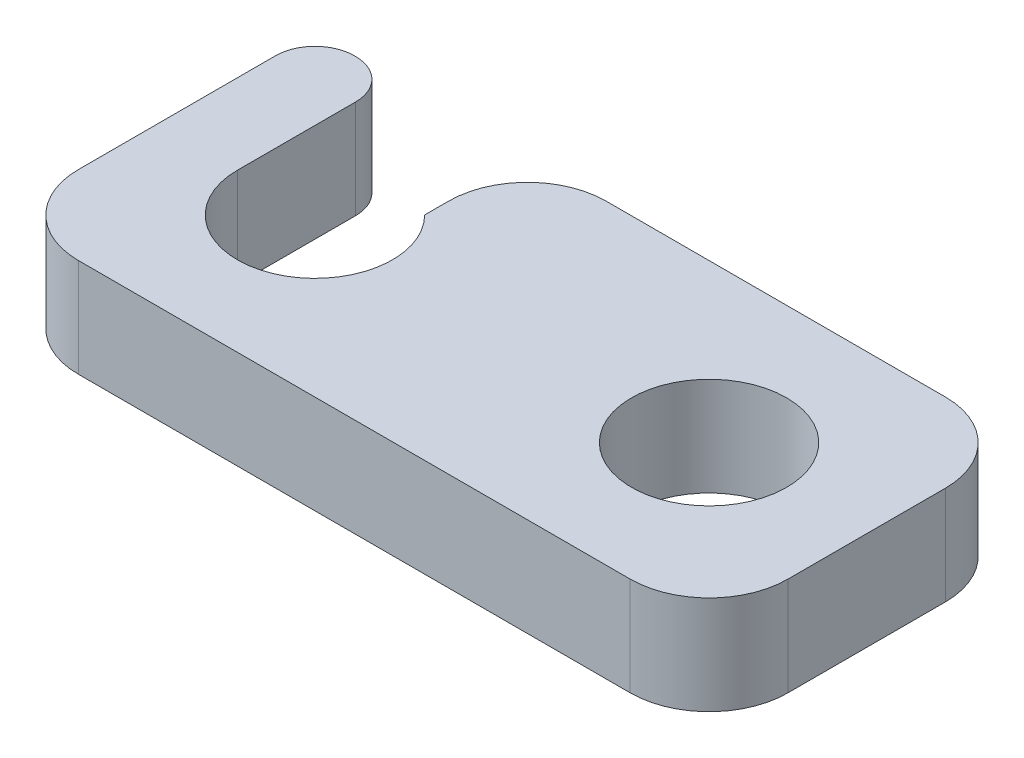
ISO-10303-21;
HEADER;
FILE_DESCRIPTION(('STEP AP214'),'2;1');
FILE_NAME('part.step','',(''),(''),'','','');
FILE_SCHEMA(('AUTOMOTIVE_DESIGN { 1 0 10303 214 1 1 1 1 }'));
ENDSEC;
DATA;
#1=APPLICATION_CONTEXT('core data for automotive mechanical design processes');
#2=APPLICATION_PROTOCOL_DEFINITION('international standard','automotive_design',2000,#1);
#3=PRODUCT_CONTEXT('',#1,'mechanical');
#4=PRODUCT('Part','Part','',(#3));
#5=PRODUCT_RELATED_PRODUCT_CATEGORY('part','',(#4));
#6=PRODUCT_DEFINITION_FORMATION('','',#4);
#7=PRODUCT_DEFINITION_CONTEXT('part definition',#1,'design');
#8=PRODUCT_DEFINITION('design','',#6,#7);
#9=PRODUCT_DEFINITION_SHAPE('','',#8);
#10=(LENGTH_UNIT() NAMED_UNIT(*) SI_UNIT(.MILLI.,.METRE.));
#11=(NAMED_UNIT(*) PLANE_ANGLE_UNIT() SI_UNIT($,.RADIAN.));
#12=(NAMED_UNIT(*) SI_UNIT($,.STERADIAN.) SOLID_ANGLE_UNIT());
#13=UNCERTAINTY_MEASURE_WITH_UNIT(LENGTH_MEASURE(1.E-05),#10,'distance_accuracy_value','');
#14=(GEOMETRIC_REPRESENTATION_CONTEXT(3) GLOBAL_UNCERTAINTY_ASSIGNED_CONTEXT((#13)) GLOBAL_UNIT_ASSIGNED_CONTEXT((#10,
#11,#12)) REPRESENTATION_CONTEXT('',''));
#15=CARTESIAN_POINT('',(0.,0.,0.));
#16=DIRECTION('',(0.,0.,1.));
#17=DIRECTION('',(1.,0.,0.));
#18=AXIS2_PLACEMENT_3D('',#15,#16,#17);
#19=CARTESIAN_POINT('',(-11.43,3.175,-5.08));
#20=DIRECTION('',(0.,0.,1.));
#21=DIRECTION('',(1.,0.,0.));
#22=AXIS2_PLACEMENT_3D('',#19,#20,#21);
#23=PLANE('',#22);
#24=DIRECTION('',(-1.,0.,0.));
#25=VECTOR('',#24,1.);
#26=CARTESIAN_POINT('',(-11.43,0.,-5.08));
#27=LINE('',#26,#25);
#28=CARTESIAN_POINT('',(-10.12,0.,-5.08));
#29=VERTEX_POINT('',#28);
#30=CARTESIAN_POINT('',(-10.16,0.,-5.08));
#31=VERTEX_POINT('',#30);
#32=EDGE_CURVE('E173',#29,#31,#27,.T.);
#33=ORIENTED_EDGE('',*,*,#32,.T.);
#34=DIRECTION('',(0.,-1.,0.));
#35=VECTOR('',#34,1.);
#36=CARTESIAN_POINT('',(-10.16,3.175,-5.08));
#37=LINE('',#36,#35);
#38=CARTESIAN_POINT('',(-10.16,3.175,-5.08));
#39=VERTEX_POINT('',#38);
#40=EDGE_CURVE('E61',#31,#39,#37,.F.);
#41=ORIENTED_EDGE('',*,*,#40,.T.);
#42=DIRECTION('',(-1.,0.,0.));
#43=VECTOR('',#42,1.);
#44=CARTESIAN_POINT('',(-11.43,3.175,-5.08));
#45=LINE('',#44,#43);
#46=CARTESIAN_POINT('',(-10.12,3.175,-5.08));
#47=VERTEX_POINT('',#46);
#48=EDGE_CURVE('E186',#47,#39,#45,.T.);
#49=ORIENTED_EDGE('',*,*,#48,.F.);
#50=DIRECTION('',(0.,1.,0.));
#51=VECTOR('',#50,1.);
#52=CARTESIAN_POINT('',(-10.12,3.175,-5.08));
#53=LINE('',#52,#51);
#54=EDGE_CURVE('E247',#47,#29,#53,.F.);
#55=ORIENTED_EDGE('',*,*,#54,.T.);
#56=EDGE_LOOP('',(#33,#41,#49,#55));
#57=FACE_BOUND('',#56,.T.);
#58=ADVANCED_FACE('F39',(#57),#23,.F.);
#59=CARTESIAN_POINT('',(-6.35,0.,0.));
#60=DIRECTION('',(0.,1.,0.));
#61=DIRECTION('',(0.,0.,1.));
#62=AXIS2_PLACEMENT_3D('',#59,#60,#61);
#63=CYLINDRICAL_SURFACE('',#62,2.5);
#64=DIRECTION('',(0.,1.,0.));
#65=VECTOR('',#64,1.);
#66=CARTESIAN_POINT('',(-8.85,0.,0.));
#67=LINE('',#66,#65);
#68=CARTESIAN_POINT('',(-8.85,0.,0.));
#69=VERTEX_POINT('',#68);
#70=CARTESIAN_POINT('',(-8.85,3.175,0.));
#71=VERTEX_POINT('',#70);
#72=EDGE_CURVE('E158',#69,#71,#67,.T.);
#73=ORIENTED_EDGE('',*,*,#72,.T.);
#74=CARTESIAN_POINT('',(-6.35,3.175,0.));
#75=DIRECTION('',(0.,1.,0.));
#76=DIRECTION('',(0.,0.,1.));
#77=AXIS2_PLACEMENT_3D('',#74,#75,#76);
#78=CIRCLE('',#77,2.5);
#79=CARTESIAN_POINT('',(-4.58454594939093,3.175,-1.77007683313127));
#80=VERTEX_POINT('',#79);
#81=EDGE_CURVE('E170',#71,#80,#78,.T.);
#82=ORIENTED_EDGE('',*,*,#81,.T.);
#83=DIRECTION('',(0.,1.,0.));
#84=VECTOR('',#83,1.);
#85=CARTESIAN_POINT('',(-4.58454594939093,0.,-1.77007683313127));
#86=LINE('',#85,#84);
#87=CARTESIAN_POINT('',(-4.58454594939093,0.,-1.77007683313127));
#88=VERTEX_POINT('',#87);
#89=EDGE_CURVE('E154',#88,#80,#86,.T.);
#90=ORIENTED_EDGE('',*,*,#89,.F.);
#91=CARTESIAN_POINT('',(-6.35,0.,0.));
#92=DIRECTION('',(0.,1.,0.));
#93=DIRECTION('',(0.,0.,1.));
#94=AXIS2_PLACEMENT_3D('',#91,#92,#93);
#95=CIRCLE('',#94,2.5);
#96=EDGE_CURVE('E149',#69,#88,#95,.T.);
#97=ORIENTED_EDGE('',*,*,#96,.F.);
#98=EDGE_LOOP('',(#73,#82,#90,#97));
#99=FACE_BOUND('',#98,.T.);
#100=ADVANCED_FACE('F168',(#99),#63,.F.);
#101=CARTESIAN_POINT('',(11.43,3.175,5.08));
#102=DIRECTION('',(-1.,0.,0.));
#103=DIRECTION('',(0.,0.,1.));
#104=AXIS2_PLACEMENT_3D('',#101,#102,#103);
#105=PLANE('',#104);
#106=DIRECTION('',(0.,0.,-1.));
#107=VECTOR('',#106,1.);
#108=CARTESIAN_POINT('',(11.43,3.175,5.08));
#109=LINE('',#108,#107);
#110=CARTESIAN_POINT('',(11.43,3.175,2.54));
#111=VERTEX_POINT('',#110);
#112=CARTESIAN_POINT('',(11.43,3.175,-2.54));
#113=VERTEX_POINT('',#112);
#114=EDGE_CURVE('E183',#111,#113,#109,.T.);
#115=ORIENTED_EDGE('',*,*,#114,.F.);
#116=DIRECTION('',(0.,-1.,0.));
#117=VECTOR('',#116,1.);
#118=CARTESIAN_POINT('',(11.43,3.175,2.54));
#119=LINE('',#118,#117);
#120=CARTESIAN_POINT('',(11.43,0.,2.54));
#121=VERTEX_POINT('',#120);
#122=EDGE_CURVE('E238',#111,#121,#119,.T.);
#123=ORIENTED_EDGE('',*,*,#122,.T.);
#124=DIRECTION('',(0.,0.,-1.));
#125=VECTOR('',#124,1.);
#126=CARTESIAN_POINT('',(11.43,0.,5.08));
#127=LINE('',#126,#125);
#128=CARTESIAN_POINT('',(11.43,0.,-2.54));
#129=VERTEX_POINT('',#128);
#130=EDGE_CURVE('E169',#121,#129,#127,.T.);
#131=ORIENTED_EDGE('',*,*,#130,.T.);
#132=DIRECTION('',(0.,-1.,0.));
#133=VECTOR('',#132,1.);
#134=CARTESIAN_POINT('',(11.43,3.175,-2.54));
#135=LINE('',#134,#133);
#136=EDGE_CURVE('E236',#129,#113,#135,.F.);
#137=ORIENTED_EDGE('',*,*,#136,.T.);
#138=EDGE_LOOP('',(#115,#123,#131,#137));
#139=FACE_BOUND('',#138,.T.);
#140=ADVANCED_FACE('F286',(#139),#105,.F.);
#141=CARTESIAN_POINT('',(8.89,0.,-5.08));
#142=VERTEX_POINT('',#141);
#143=CARTESIAN_POINT('',(-2.04454594939093,0.,-5.08));
#144=VERTEX_POINT('',#143);
#145=EDGE_CURVE('E197',#142,#144,#27,.T.);
#146=ORIENTED_EDGE('',*,*,#145,.T.);
#147=DIRECTION('',(0.,1.,0.));
#148=VECTOR('',#147,1.);
#149=CARTESIAN_POINT('',(-2.04454594939093,3.175,-5.08));
#150=LINE('',#149,#148);
#151=CARTESIAN_POINT('',(-2.04454594939093,3.175,-5.08));
#152=VERTEX_POINT('',#151);
#153=EDGE_CURVE('E231',#144,#152,#150,.T.);
#154=ORIENTED_EDGE('',*,*,#153,.T.);
#155=CARTESIAN_POINT('',(8.89,3.175,-5.08));
#156=VERTEX_POINT('',#155);
#157=EDGE_CURVE('E188',#156,#152,#45,.T.);
#158=ORIENTED_EDGE('',*,*,#157,.F.);
#159=DIRECTION('',(0.,-1.,0.));
#160=VECTOR('',#159,1.);
#161=CARTESIAN_POINT('',(8.89,3.175,-5.08));
#162=LINE('',#161,#160);
#163=EDGE_CURVE('E228',#156,#142,#162,.T.);
#164=ORIENTED_EDGE('',*,*,#163,.T.);
#165=EDGE_LOOP('',(#146,#154,#158,#164));
#166=FACE_BOUND('',#165,.T.);
#167=ADVANCED_FACE('F276',(#166),#23,.F.);
#168=CARTESIAN_POINT('',(-11.43,3.175,5.08));
#169=DIRECTION('',(1.,0.,0.));
#170=DIRECTION('',(0.,0.,-1.));
#171=AXIS2_PLACEMENT_3D('',#168,#169,#170);
#172=PLANE('',#171);
#173=DIRECTION('',(0.,0.,1.));
#174=VECTOR('',#173,1.);
#175=CARTESIAN_POINT('',(-11.43,3.175,5.08));
#176=LINE('',#175,#174);
#177=CARTESIAN_POINT('',(-11.43,3.175,-3.81));
#178=VERTEX_POINT('',#177);
#179=CARTESIAN_POINT('',(-11.43,3.175,2.54));
#180=VERTEX_POINT('',#179);
#181=EDGE_CURVE('E191',#178,#180,#176,.T.);
#182=ORIENTED_EDGE('',*,*,#181,.F.);
#183=DIRECTION('',(0.,-1.,0.));
#184=VECTOR('',#183,1.);
#185=CARTESIAN_POINT('',(-11.43,3.175,-3.81));
#186=LINE('',#185,#184);
#187=CARTESIAN_POINT('',(-11.43,0.,-3.81));
#188=VERTEX_POINT('',#187);
#189=EDGE_CURVE('E241',#178,#188,#186,.T.);
#190=ORIENTED_EDGE('',*,*,#189,.T.);
#191=DIRECTION('',(0.,0.,1.));
#192=VECTOR('',#191,1.);
#193=CARTESIAN_POINT('',(-11.43,0.,5.08));
#194=LINE('',#193,#192);
#195=CARTESIAN_POINT('',(-11.43,0.,2.54));
#196=VERTEX_POINT('',#195);
#197=EDGE_CURVE('E200',#188,#196,#194,.T.);
#198=ORIENTED_EDGE('',*,*,#197,.T.);
#199=DIRECTION('',(0.,-1.,0.));
#200=VECTOR('',#199,1.);
#201=CARTESIAN_POINT('',(-11.43,3.175,2.54));
#202=LINE('',#201,#200);
#203=EDGE_CURVE('E217',#196,#180,#202,.F.);
#204=ORIENTED_EDGE('',*,*,#203,.T.);
#205=EDGE_LOOP('',(#182,#190,#198,#204));
#206=FACE_BOUND('',#205,.T.);
#207=ADVANCED_FACE('F257',(#206),#172,.F.);
#208=CARTESIAN_POINT('',(-11.43,3.175,5.08));
#209=DIRECTION('',(0.,0.,-1.));
#210=DIRECTION('',(-1.,0.,0.));
#211=AXIS2_PLACEMENT_3D('',#208,#209,#210);
#212=PLANE('',#211);
#213=DIRECTION('',(1.,0.,0.));
#214=VECTOR('',#213,1.);
#215=CARTESIAN_POINT('',(-11.43,3.175,5.08));
#216=LINE('',#215,#214);
#217=CARTESIAN_POINT('',(-8.89,3.175,5.08));
#218=VERTEX_POINT('',#217);
#219=CARTESIAN_POINT('',(8.89,3.175,5.08));
#220=VERTEX_POINT('',#219);
#221=EDGE_CURVE('E193',#218,#220,#216,.T.);
#222=ORIENTED_EDGE('',*,*,#221,.F.);
#223=DIRECTION('',(0.,-1.,0.));
#224=VECTOR('',#223,1.);
#225=CARTESIAN_POINT('',(-8.89,3.175,5.08));
#226=LINE('',#225,#224);
#227=CARTESIAN_POINT('',(-8.89,0.,5.08));
#228=VERTEX_POINT('',#227);
#229=EDGE_CURVE('E205',#218,#228,#226,.T.);
#230=ORIENTED_EDGE('',*,*,#229,.T.);
#231=DIRECTION('',(1.,0.,0.));
#232=VECTOR('',#231,1.);
#233=CARTESIAN_POINT('',(-11.43,0.,5.08));
#234=LINE('',#233,#232);
#235=CARTESIAN_POINT('',(8.89,0.,5.08));
#236=VERTEX_POINT('',#235);
#237=EDGE_CURVE('E187',#228,#236,#234,.T.);
#238=ORIENTED_EDGE('',*,*,#237,.T.);
#239=DIRECTION('',(0.,-1.,0.));
#240=VECTOR('',#239,1.);
#241=CARTESIAN_POINT('',(8.89,3.175,5.08));
#242=LINE('',#241,#240);
#243=EDGE_CURVE('E195',#236,#220,#242,.F.);
#244=ORIENTED_EDGE('',*,*,#243,.T.);
#245=EDGE_LOOP('',(#222,#230,#238,#244));
#246=FACE_BOUND('',#245,.T.);
#247=ADVANCED_FACE('F295',(#246),#212,.F.);
#248=CARTESIAN_POINT('',(0.,3.175,0.));
#249=DIRECTION('',(0.,-1.,0.));
#250=DIRECTION('',(0.,0.,-1.));
#251=AXIS2_PLACEMENT_3D('',#248,#249,#250);
#252=PLANE('',#251);
#253=CARTESIAN_POINT('',(6.35,3.175,0.));
#254=DIRECTION('',(0.,1.,0.));
#255=DIRECTION('',(0.,0.,-1.));
#256=AXIS2_PLACEMENT_3D('',#253,#254,#255);
#257=CIRCLE('',#256,2.5);
#258=CARTESIAN_POINT('',(6.35,3.175,-2.5));
#259=VERTEX_POINT('',#258);
#260=EDGE_CURVE('E175',#259,#259,#257,.T.);
#261=ORIENTED_EDGE('',*,*,#260,.F.);
#262=EDGE_LOOP('',(#261));
#263=FACE_BOUND('',#262,.T.);
#264=ORIENTED_EDGE('',*,*,#48,.T.);
#265=CARTESIAN_POINT('',(-10.16,3.175,-3.81));
#266=DIRECTION('',(0.,-1.,0.));
#267=DIRECTION('',(0.,0.,-1.));
#268=AXIS2_PLACEMENT_3D('',#265,#266,#267);
#269=CIRCLE('',#268,1.27);
#270=EDGE_CURVE('E47',#39,#178,#269,.F.);
#271=ORIENTED_EDGE('',*,*,#270,.T.);
#272=ORIENTED_EDGE('',*,*,#181,.T.);
#273=CARTESIAN_POINT('',(-8.89,3.175,2.54));
#274=DIRECTION('',(0.,-1.,0.));
#275=DIRECTION('',(0.,0.,-1.));
#276=AXIS2_PLACEMENT_3D('',#273,#274,#275);
#277=CIRCLE('',#276,2.54);
#278=EDGE_CURVE('E226',#180,#218,#277,.F.);
#279=ORIENTED_EDGE('',*,*,#278,.T.);
#280=ORIENTED_EDGE('',*,*,#221,.T.);
#281=CARTESIAN_POINT('',(8.89,3.175,2.54));
#282=DIRECTION('',(0.,-1.,0.));
#283=DIRECTION('',(0.,0.,-1.));
#284=AXIS2_PLACEMENT_3D('',#281,#282,#283);
#285=CIRCLE('',#284,2.54);
#286=EDGE_CURVE('E222',#220,#111,#285,.F.);
#287=ORIENTED_EDGE('',*,*,#286,.T.);
#288=ORIENTED_EDGE('',*,*,#114,.T.);
#289=CARTESIAN_POINT('',(8.89,3.175,-2.54));
#290=DIRECTION('',(0.,-1.,0.));
#291=DIRECTION('',(0.,0.,-1.));
#292=AXIS2_PLACEMENT_3D('',#289,#290,#291);
#293=CIRCLE('',#292,2.54);
#294=EDGE_CURVE('E220',#113,#156,#293,.F.);
#295=ORIENTED_EDGE('',*,*,#294,.T.);
#296=ORIENTED_EDGE('',*,*,#157,.T.);
#297=CARTESIAN_POINT('',(-2.04454594939093,3.175,-2.54));
#298=DIRECTION('',(0.,-1.,0.));
#299=DIRECTION('',(0.,0.,-1.));
#300=AXIS2_PLACEMENT_3D('',#297,#298,#299);
#301=CIRCLE('',#300,2.54);
#302=CARTESIAN_POINT('',(-4.58454594939093,3.175,-2.54));
#303=VERTEX_POINT('',#302);
#304=EDGE_CURVE('E224',#152,#303,#301,.F.);
#305=ORIENTED_EDGE('',*,*,#304,.T.);
#306=DIRECTION('',(0.,0.,-1.));
#307=VECTOR('',#306,1.);
#308=CARTESIAN_POINT('',(-4.58454594939093,3.175,-5.08));
#309=LINE('',#308,#307);
#310=EDGE_CURVE('E262',#80,#303,#309,.T.);
#311=ORIENTED_EDGE('',*,*,#310,.F.);
#312=ORIENTED_EDGE('',*,*,#81,.F.);
#313=DIRECTION('',(0.,0.,1.));
#314=VECTOR('',#313,1.);
#315=CARTESIAN_POINT('',(-8.85,3.175,0.));
#316=LINE('',#315,#314);
#317=CARTESIAN_POINT('',(-8.85,3.175,-3.81));
#318=VERTEX_POINT('',#317);
#319=EDGE_CURVE('E161',#318,#71,#316,.T.);
#320=ORIENTED_EDGE('',*,*,#319,.F.);
#321=CARTESIAN_POINT('',(-10.12,3.175,-3.81));
#322=DIRECTION('',(0.,-1.,0.));
#323=DIRECTION('',(0.,0.,-1.));
#324=AXIS2_PLACEMENT_3D('',#321,#322,#323);
#325=CIRCLE('',#324,1.27);
#326=EDGE_CURVE('E54',#318,#47,#325,.F.);
#327=ORIENTED_EDGE('',*,*,#326,.T.);
#328=EDGE_LOOP('',(#264,#271,#272,#279,#280,#287,#288,#295,#296,#305,#311,#312,#320,#327));
#329=FACE_BOUND('',#328,.T.);
#330=ADVANCED_FACE('F253',(#263,#329),#252,.F.);
#331=CARTESIAN_POINT('',(0.,0.,0.));
#332=DIRECTION('',(0.,-1.,0.));
#333=DIRECTION('',(0.,0.,-1.));
#334=AXIS2_PLACEMENT_3D('',#331,#332,#333);
#335=PLANE('',#334);
#336=ORIENTED_EDGE('',*,*,#197,.F.);
#337=CARTESIAN_POINT('',(-10.16,0.,-3.81));
#338=DIRECTION('',(0.,-1.,0.));
#339=DIRECTION('',(0.,0.,-1.));
#340=AXIS2_PLACEMENT_3D('',#337,#338,#339);
#341=CIRCLE('',#340,1.27);
#342=EDGE_CURVE('E245',#188,#31,#341,.T.);
#343=ORIENTED_EDGE('',*,*,#342,.T.);
#344=ORIENTED_EDGE('',*,*,#32,.F.);
#345=CARTESIAN_POINT('',(-10.12,0.,-3.81));
#346=DIRECTION('',(0.,-1.,0.));
#347=DIRECTION('',(0.,0.,-1.));
#348=AXIS2_PLACEMENT_3D('',#345,#346,#347);
#349=CIRCLE('',#348,1.27);
#350=CARTESIAN_POINT('',(-8.85,0.,-3.81));
#351=VERTEX_POINT('',#350);
#352=EDGE_CURVE('E152',#29,#351,#349,.T.);
#353=ORIENTED_EDGE('',*,*,#352,.T.);
#354=DIRECTION('',(0.,0.,1.));
#355=VECTOR('',#354,1.);
#356=CARTESIAN_POINT('',(-8.85,0.,0.));
#357=LINE('',#356,#355);
#358=EDGE_CURVE('E142',#351,#69,#357,.T.);
#359=ORIENTED_EDGE('',*,*,#358,.T.);
#360=ORIENTED_EDGE('',*,*,#96,.T.);
#361=DIRECTION('',(0.,0.,-1.));
#362=VECTOR('',#361,1.);
#363=CARTESIAN_POINT('',(-4.58454594939093,0.,-5.08));
#364=LINE('',#363,#362);
#365=CARTESIAN_POINT('',(-4.58454594939093,0.,-2.54));
#366=VERTEX_POINT('',#365);
#367=EDGE_CURVE('E155',#88,#366,#364,.T.);
#368=ORIENTED_EDGE('',*,*,#367,.T.);
#369=CARTESIAN_POINT('',(-2.04454594939093,0.,-2.54));
#370=DIRECTION('',(0.,-1.,0.));
#371=DIRECTION('',(0.,0.,-1.));
#372=AXIS2_PLACEMENT_3D('',#369,#370,#371);
#373=CIRCLE('',#372,2.54);
#374=EDGE_CURVE('E212',#366,#144,#373,.T.);
#375=ORIENTED_EDGE('',*,*,#374,.T.);
#376=ORIENTED_EDGE('',*,*,#145,.F.);
#377=CARTESIAN_POINT('',(8.89,0.,-2.54));
#378=DIRECTION('',(0.,-1.,0.));
#379=DIRECTION('',(0.,0.,-1.));
#380=AXIS2_PLACEMENT_3D('',#377,#378,#379);
#381=CIRCLE('',#380,2.54);
#382=EDGE_CURVE('E208',#142,#129,#381,.T.);
#383=ORIENTED_EDGE('',*,*,#382,.T.);
#384=ORIENTED_EDGE('',*,*,#130,.F.);
#385=CARTESIAN_POINT('',(8.89,0.,2.54));
#386=DIRECTION('',(0.,-1.,0.));
#387=DIRECTION('',(0.,0.,-1.));
#388=AXIS2_PLACEMENT_3D('',#385,#386,#387);
#389=CIRCLE('',#388,2.54);
#390=EDGE_CURVE('E210',#121,#236,#389,.T.);
#391=ORIENTED_EDGE('',*,*,#390,.T.);
#392=ORIENTED_EDGE('',*,*,#237,.F.);
#393=CARTESIAN_POINT('',(-8.89,0.,2.54));
#394=DIRECTION('',(0.,-1.,0.));
#395=DIRECTION('',(0.,0.,-1.));
#396=AXIS2_PLACEMENT_3D('',#393,#394,#395);
#397=CIRCLE('',#396,2.54);
#398=EDGE_CURVE('E214',#228,#196,#397,.T.);
#399=ORIENTED_EDGE('',*,*,#398,.T.);
#400=EDGE_LOOP('',(#336,#343,#344,#353,#359,#360,#368,#375,#376,#383,#384,#391,#392,#399));
#401=FACE_BOUND('',#400,.T.);
#402=CARTESIAN_POINT('',(6.35,0.,0.));
#403=DIRECTION('',(0.,1.,0.));
#404=DIRECTION('',(0.,0.,-1.));
#405=AXIS2_PLACEMENT_3D('',#402,#403,#404);
#406=CIRCLE('',#405,2.5);
#407=CARTESIAN_POINT('',(6.35,0.,-2.5));
#408=VERTEX_POINT('',#407);
#409=EDGE_CURVE('E165',#408,#408,#406,.T.);
#410=ORIENTED_EDGE('',*,*,#409,.T.);
#411=EDGE_LOOP('',(#410));
#412=FACE_BOUND('',#411,.T.);
#413=ADVANCED_FACE('F145',(#401,#412),#335,.T.);
#414=CARTESIAN_POINT('',(6.35,0.,0.));
#415=DIRECTION('',(0.,1.,0.));
#416=DIRECTION('',(0.,0.,1.));
#417=AXIS2_PLACEMENT_3D('',#414,#415,#416);
#418=CYLINDRICAL_SURFACE('',#417,2.5);
#419=ORIENTED_EDGE('',*,*,#409,.F.);
#420=EDGE_LOOP('',(#419));
#421=FACE_BOUND('',#420,.T.);
#422=ORIENTED_EDGE('',*,*,#260,.T.);
#423=EDGE_LOOP('',(#422));
#424=FACE_BOUND('',#423,.T.);
#425=ADVANCED_FACE('F334',(#421,#424),#418,.F.);
#426=CARTESIAN_POINT('',(-4.58454594939093,0.,-5.08));
#427=DIRECTION('',(1.,0.,0.));
#428=DIRECTION('',(0.,0.,-1.));
#429=AXIS2_PLACEMENT_3D('',#426,#427,#428);
#430=PLANE('',#429);
#431=ORIENTED_EDGE('',*,*,#310,.T.);
#432=DIRECTION('',(0.,1.,0.));
#433=VECTOR('',#432,1.);
#434=CARTESIAN_POINT('',(-4.58454594939093,0.,-2.54));
#435=LINE('',#434,#433);
#436=EDGE_CURVE('E234',#303,#366,#435,.F.);
#437=ORIENTED_EDGE('',*,*,#436,.T.);
#438=ORIENTED_EDGE('',*,*,#367,.F.);
#439=ORIENTED_EDGE('',*,*,#89,.T.);
#440=EDGE_LOOP('',(#431,#437,#438,#439));
#441=FACE_BOUND('',#440,.T.);
#442=ADVANCED_FACE('F269',(#441),#430,.F.);
#443=CARTESIAN_POINT('',(-8.85,0.,0.));
#444=DIRECTION('',(-1.,0.,0.));
#445=DIRECTION('',(0.,0.,1.));
#446=AXIS2_PLACEMENT_3D('',#443,#444,#445);
#447=PLANE('',#446);
#448=ORIENTED_EDGE('',*,*,#358,.F.);
#449=DIRECTION('',(0.,1.,0.));
#450=VECTOR('',#449,1.);
#451=CARTESIAN_POINT('',(-8.85,0.,-3.81));
#452=LINE('',#451,#450);
#453=EDGE_CURVE('E11',#351,#318,#452,.T.);
#454=ORIENTED_EDGE('',*,*,#453,.T.);
#455=ORIENTED_EDGE('',*,*,#319,.T.);
#456=ORIENTED_EDGE('',*,*,#72,.F.);
#457=EDGE_LOOP('',(#448,#454,#455,#456));
#458=FACE_BOUND('',#457,.T.);
#459=ADVANCED_FACE('F159',(#458),#447,.F.);
#460=CARTESIAN_POINT('',(-8.89,3.175,2.54));
#461=DIRECTION('',(0.,-1.,0.));
#462=DIRECTION('',(0.,0.,-1.));
#463=AXIS2_PLACEMENT_3D('',#460,#461,#462);
#464=CYLINDRICAL_SURFACE('',#463,2.54);
#465=ORIENTED_EDGE('',*,*,#278,.F.);
#466=ORIENTED_EDGE('',*,*,#203,.F.);
#467=ORIENTED_EDGE('',*,*,#398,.F.);
#468=ORIENTED_EDGE('',*,*,#229,.F.);
#469=EDGE_LOOP('',(#465,#466,#467,#468));
#470=FACE_BOUND('',#469,.T.);
#471=ADVANCED_FACE('F298',(#470),#464,.T.);
#472=CARTESIAN_POINT('',(-2.04454594939093,3.175,-2.54));
#473=DIRECTION('',(0.,1.,0.));
#474=DIRECTION('',(0.,0.,1.));
#475=AXIS2_PLACEMENT_3D('',#472,#473,#474);
#476=CYLINDRICAL_SURFACE('',#475,2.54);
#477=ORIENTED_EDGE('',*,*,#374,.F.);
#478=ORIENTED_EDGE('',*,*,#436,.F.);
#479=ORIENTED_EDGE('',*,*,#304,.F.);
#480=ORIENTED_EDGE('',*,*,#153,.F.);
#481=EDGE_LOOP('',(#477,#478,#479,#480));
#482=FACE_BOUND('',#481,.T.);
#483=ADVANCED_FACE('F272',(#482),#476,.T.);
#484=CARTESIAN_POINT('',(8.89,3.175,2.54));
#485=DIRECTION('',(0.,-1.,0.));
#486=DIRECTION('',(0.,0.,-1.));
#487=AXIS2_PLACEMENT_3D('',#484,#485,#486);
#488=CYLINDRICAL_SURFACE('',#487,2.54);
#489=ORIENTED_EDGE('',*,*,#286,.F.);
#490=ORIENTED_EDGE('',*,*,#243,.F.);
#491=ORIENTED_EDGE('',*,*,#390,.F.);
#492=ORIENTED_EDGE('',*,*,#122,.F.);
#493=EDGE_LOOP('',(#489,#490,#491,#492));
#494=FACE_BOUND('',#493,.T.);
#495=ADVANCED_FACE('F290',(#494),#488,.T.);
#496=CARTESIAN_POINT('',(8.89,3.175,-2.54));
#497=DIRECTION('',(0.,-1.,0.));
#498=DIRECTION('',(0.,0.,-1.));
#499=AXIS2_PLACEMENT_3D('',#496,#497,#498);
#500=CYLINDRICAL_SURFACE('',#499,2.54);
#501=ORIENTED_EDGE('',*,*,#294,.F.);
#502=ORIENTED_EDGE('',*,*,#136,.F.);
#503=ORIENTED_EDGE('',*,*,#382,.F.);
#504=ORIENTED_EDGE('',*,*,#163,.F.);
#505=EDGE_LOOP('',(#501,#502,#503,#504));
#506=FACE_BOUND('',#505,.T.);
#507=ADVANCED_FACE('F281',(#506),#500,.T.);
#508=CARTESIAN_POINT('',(-10.16,3.175,-3.81));
#509=DIRECTION('',(0.,-1.,0.));
#510=DIRECTION('',(0.,0.,-1.));
#511=AXIS2_PLACEMENT_3D('',#508,#509,#510);
#512=CYLINDRICAL_SURFACE('',#511,1.27);
#513=ORIENTED_EDGE('',*,*,#270,.F.);
#514=ORIENTED_EDGE('',*,*,#40,.F.);
#515=ORIENTED_EDGE('',*,*,#342,.F.);
#516=ORIENTED_EDGE('',*,*,#189,.F.);
#517=EDGE_LOOP('',(#513,#514,#515,#516));
#518=FACE_BOUND('',#517,.T.);
#519=ADVANCED_FACE('F260',(#518),#512,.T.);
#520=CARTESIAN_POINT('',(-10.12,0.,-3.81));
#521=DIRECTION('',(0.,1.,0.));
#522=DIRECTION('',(0.,0.,1.));
#523=AXIS2_PLACEMENT_3D('',#520,#521,#522);
#524=CYLINDRICAL_SURFACE('',#523,1.27);
#525=ORIENTED_EDGE('',*,*,#352,.F.);
#526=ORIENTED_EDGE('',*,*,#54,.F.);
#527=ORIENTED_EDGE('',*,*,#326,.F.);
#528=ORIENTED_EDGE('',*,*,#453,.F.);
#529=EDGE_LOOP('',(#525,#526,#527,#528));
#530=FACE_BOUND('',#529,.T.);
#531=ADVANCED_FACE('F41',(#530),#524,.T.);
#532=CLOSED_SHELL('',(#58,#100,#140,#167,#207,#247,#330,#413,#425,#442,#459,#471,#483,#495,#507,
#519,#531));
#533=MANIFOLD_SOLID_BREP('B2',#532);
#534=ADVANCED_BREP_SHAPE_REPRESENTATION('',(#18,#533),#14);
#535=SHAPE_DEFINITION_REPRESENTATION(#9,#534);
ENDSEC;
END-ISO-10303-21;
